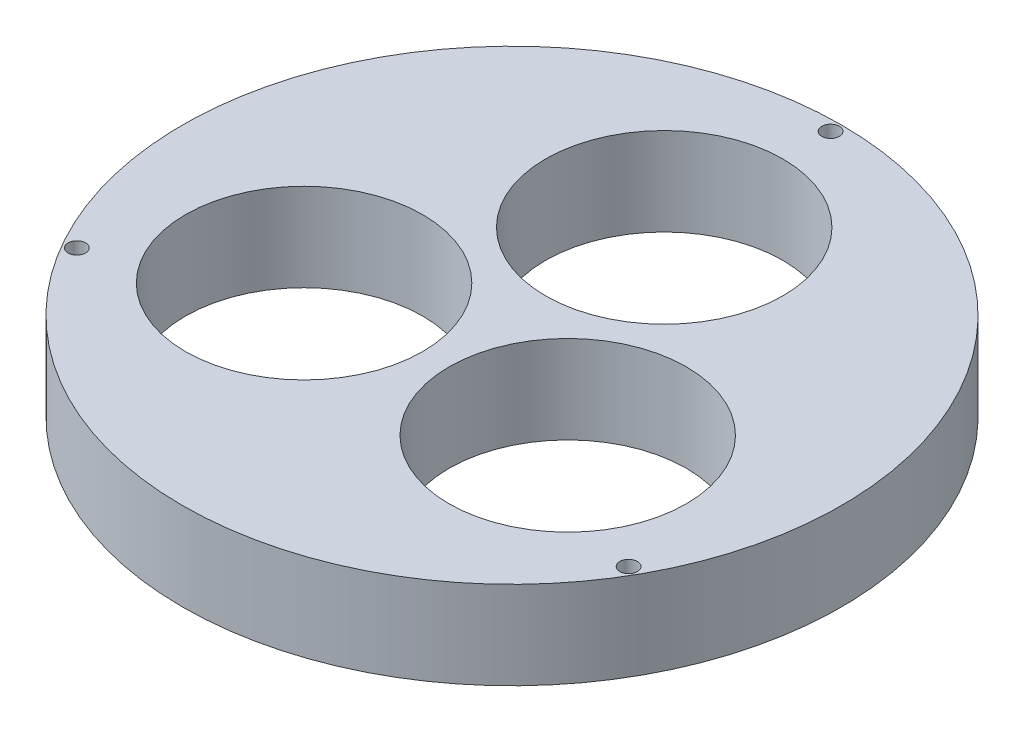
ISO-10303-21;
HEADER;
FILE_DESCRIPTION(('STEP AP214'),'2;1');
FILE_NAME('part.step','',(''),(''),'','','');
FILE_SCHEMA(('AUTOMOTIVE_DESIGN { 1 0 10303 214 1 1 1 1 }'));
ENDSEC;
DATA;
#1=APPLICATION_CONTEXT('core data for automotive mechanical design processes');
#2=APPLICATION_PROTOCOL_DEFINITION('international standard','automotive_design',2000,#1);
#3=PRODUCT_CONTEXT('',#1,'mechanical');
#4=PRODUCT('Part','Part','',(#3));
#5=PRODUCT_RELATED_PRODUCT_CATEGORY('part','',(#4));
#6=PRODUCT_DEFINITION_FORMATION('','',#4);
#7=PRODUCT_DEFINITION_CONTEXT('part definition',#1,'design');
#8=PRODUCT_DEFINITION('design','',#6,#7);
#9=PRODUCT_DEFINITION_SHAPE('','',#8);
#10=(LENGTH_UNIT() NAMED_UNIT(*) SI_UNIT(.MILLI.,.METRE.));
#11=(NAMED_UNIT(*) PLANE_ANGLE_UNIT() SI_UNIT($,.RADIAN.));
#12=(NAMED_UNIT(*) SI_UNIT($,.STERADIAN.) SOLID_ANGLE_UNIT());
#13=UNCERTAINTY_MEASURE_WITH_UNIT(LENGTH_MEASURE(1.E-05),#10,'distance_accuracy_value','');
#14=(GEOMETRIC_REPRESENTATION_CONTEXT(3) GLOBAL_UNCERTAINTY_ASSIGNED_CONTEXT((#13)) GLOBAL_UNIT_ASSIGNED_CONTEXT((#10,
#11,#12)) REPRESENTATION_CONTEXT('',''));
#15=CARTESIAN_POINT('',(0.,0.,0.));
#16=DIRECTION('',(0.,0.,1.));
#17=DIRECTION('',(1.,0.,0.));
#18=AXIS2_PLACEMENT_3D('',#15,#16,#17);
#19=CARTESIAN_POINT('',(0.,10.,0.));
#20=DIRECTION('',(0.,1.,0.));
#21=DIRECTION('',(0.,0.,1.));
#22=AXIS2_PLACEMENT_3D('',#19,#20,#21);
#23=PLANE('',#22);
#24=CARTESIAN_POINT('',(0.,10.,-36.25));
#25=DIRECTION('',(0.,1.,0.));
#26=DIRECTION('',(0.,0.,1.));
#27=AXIS2_PLACEMENT_3D('',#24,#25,#26);
#28=CIRCLE('',#27,1.);
#29=CARTESIAN_POINT('',(0.,10.,-35.25));
#30=VERTEX_POINT('',#29);
#31=EDGE_CURVE('E80',#30,#30,#28,.T.);
#32=ORIENTED_EDGE('',*,*,#31,.F.);
#33=EDGE_LOOP('',(#32));
#34=FACE_BOUND('',#33,.T.);
#35=CARTESIAN_POINT('',(-14.9995599935465,10.,8.66));
#36=DIRECTION('',(0.,1.,0.));
#37=DIRECTION('',(0.,0.,1.));
#38=AXIS2_PLACEMENT_3D('',#35,#36,#37);
#39=CIRCLE('',#38,13.5);
#40=CARTESIAN_POINT('',(-14.9995599935465,10.,22.16));
#41=VERTEX_POINT('',#40);
#42=EDGE_CURVE('E64',#41,#41,#39,.T.);
#43=ORIENTED_EDGE('',*,*,#42,.F.);
#44=EDGE_LOOP('',(#43));
#45=FACE_BOUND('',#44,.T.);
#46=CARTESIAN_POINT('',(14.9995599935465,10.,8.66));
#47=DIRECTION('',(0.,1.,0.));
#48=DIRECTION('',(0.,0.,1.));
#49=AXIS2_PLACEMENT_3D('',#46,#47,#48);
#50=CIRCLE('',#49,13.5);
#51=CARTESIAN_POINT('',(14.9995599935465,10.,22.16));
#52=VERTEX_POINT('',#51);
#53=EDGE_CURVE('E50',#52,#52,#50,.T.);
#54=ORIENTED_EDGE('',*,*,#53,.F.);
#55=EDGE_LOOP('',(#54));
#56=FACE_BOUND('',#55,.T.);
#57=CARTESIAN_POINT('',(0.,10.,0.));
#58=DIRECTION('',(0.,1.,0.));
#59=DIRECTION('',(0.,0.,1.));
#60=AXIS2_PLACEMENT_3D('',#57,#58,#59);
#61=CIRCLE('',#60,37.5);
#62=CARTESIAN_POINT('',(0.,10.,37.5));
#63=VERTEX_POINT('',#62);
#64=EDGE_CURVE('E10',#63,#63,#61,.T.);
#65=ORIENTED_EDGE('',*,*,#64,.T.);
#66=EDGE_LOOP('',(#65));
#67=FACE_BOUND('',#66,.T.);
#68=CARTESIAN_POINT('',(0.,10.,-17.32));
#69=DIRECTION('',(0.,1.,0.));
#70=DIRECTION('',(0.,0.,1.));
#71=AXIS2_PLACEMENT_3D('',#68,#69,#70);
#72=CIRCLE('',#71,13.5);
#73=CARTESIAN_POINT('',(0.,10.,-3.82));
#74=VERTEX_POINT('',#73);
#75=EDGE_CURVE('E56',#74,#74,#72,.T.);
#76=ORIENTED_EDGE('',*,*,#75,.F.);
#77=EDGE_LOOP('',(#76));
#78=FACE_BOUND('',#77,.T.);
#79=CARTESIAN_POINT('',(31.3934208871859,10.,18.125));
#80=DIRECTION('',(0.,1.,0.));
#81=DIRECTION('',(0.,0.,1.));
#82=AXIS2_PLACEMENT_3D('',#79,#80,#81);
#83=CIRCLE('',#82,0.999999999999998);
#84=CARTESIAN_POINT('',(31.3934208871859,10.,19.125));
#85=VERTEX_POINT('',#84);
#86=EDGE_CURVE('E72',#85,#85,#83,.T.);
#87=ORIENTED_EDGE('',*,*,#86,.F.);
#88=EDGE_LOOP('',(#87));
#89=FACE_BOUND('',#88,.T.);
#90=CARTESIAN_POINT('',(-31.3934208871859,10.,18.125));
#91=DIRECTION('',(0.,1.,0.));
#92=DIRECTION('',(0.,0.,1.));
#93=AXIS2_PLACEMENT_3D('',#90,#91,#92);
#94=CIRCLE('',#93,1.);
#95=CARTESIAN_POINT('',(-31.3934208871859,10.,19.125));
#96=VERTEX_POINT('',#95);
#97=EDGE_CURVE('E88',#96,#96,#94,.T.);
#98=ORIENTED_EDGE('',*,*,#97,.F.);
#99=EDGE_LOOP('',(#98));
#100=FACE_BOUND('',#99,.T.);
#101=ADVANCED_FACE('F37',(#34,#45,#56,#67,#78,#89,#100),#23,.T.);
#102=CARTESIAN_POINT('',(0.,0.,0.));
#103=DIRECTION('',(0.,1.,0.));
#104=DIRECTION('',(0.,0.,1.));
#105=AXIS2_PLACEMENT_3D('',#102,#103,#104);
#106=PLANE('',#105);
#107=CARTESIAN_POINT('',(0.,0.,0.));
#108=DIRECTION('',(0.,1.,0.));
#109=DIRECTION('',(0.,0.,1.));
#110=AXIS2_PLACEMENT_3D('',#107,#108,#109);
#111=CIRCLE('',#110,37.5);
#112=CARTESIAN_POINT('',(0.,0.,37.5));
#113=VERTEX_POINT('',#112);
#114=EDGE_CURVE('E41',#113,#113,#111,.T.);
#115=ORIENTED_EDGE('',*,*,#114,.F.);
#116=EDGE_LOOP('',(#115));
#117=FACE_BOUND('',#116,.T.);
#118=CARTESIAN_POINT('',(14.9995599935465,0.,8.66));
#119=DIRECTION('',(0.,1.,0.));
#120=DIRECTION('',(0.,0.,1.));
#121=AXIS2_PLACEMENT_3D('',#118,#119,#120);
#122=CIRCLE('',#121,13.5);
#123=CARTESIAN_POINT('',(14.9995599935465,0.,22.16));
#124=VERTEX_POINT('',#123);
#125=EDGE_CURVE('E52',#124,#124,#122,.T.);
#126=ORIENTED_EDGE('',*,*,#125,.T.);
#127=EDGE_LOOP('',(#126));
#128=FACE_BOUND('',#127,.T.);
#129=CARTESIAN_POINT('',(0.,0.,-17.32));
#130=DIRECTION('',(0.,1.,0.));
#131=DIRECTION('',(0.,0.,1.));
#132=AXIS2_PLACEMENT_3D('',#129,#130,#131);
#133=CIRCLE('',#132,13.5);
#134=CARTESIAN_POINT('',(0.,0.,-3.82));
#135=VERTEX_POINT('',#134);
#136=EDGE_CURVE('E60',#135,#135,#133,.T.);
#137=ORIENTED_EDGE('',*,*,#136,.T.);
#138=EDGE_LOOP('',(#137));
#139=FACE_BOUND('',#138,.T.);
#140=CARTESIAN_POINT('',(-14.9995599935465,0.,8.66));
#141=DIRECTION('',(0.,1.,0.));
#142=DIRECTION('',(0.,0.,1.));
#143=AXIS2_PLACEMENT_3D('',#140,#141,#142);
#144=CIRCLE('',#143,13.5);
#145=CARTESIAN_POINT('',(-14.9995599935465,0.,22.16));
#146=VERTEX_POINT('',#145);
#147=EDGE_CURVE('E68',#146,#146,#144,.T.);
#148=ORIENTED_EDGE('',*,*,#147,.T.);
#149=EDGE_LOOP('',(#148));
#150=FACE_BOUND('',#149,.T.);
#151=CARTESIAN_POINT('',(31.3934208871859,0.,18.125));
#152=DIRECTION('',(0.,1.,0.));
#153=DIRECTION('',(0.,0.,1.));
#154=AXIS2_PLACEMENT_3D('',#151,#152,#153);
#155=CIRCLE('',#154,0.999999999999998);
#156=CARTESIAN_POINT('',(31.3934208871859,0.,19.125));
#157=VERTEX_POINT('',#156);
#158=EDGE_CURVE('E76',#157,#157,#155,.T.);
#159=ORIENTED_EDGE('',*,*,#158,.T.);
#160=EDGE_LOOP('',(#159));
#161=FACE_BOUND('',#160,.T.);
#162=CARTESIAN_POINT('',(0.,0.,-36.25));
#163=DIRECTION('',(0.,1.,0.));
#164=DIRECTION('',(0.,0.,1.));
#165=AXIS2_PLACEMENT_3D('',#162,#163,#164);
#166=CIRCLE('',#165,1.);
#167=CARTESIAN_POINT('',(0.,0.,-35.25));
#168=VERTEX_POINT('',#167);
#169=EDGE_CURVE('E84',#168,#168,#166,.T.);
#170=ORIENTED_EDGE('',*,*,#169,.T.);
#171=EDGE_LOOP('',(#170));
#172=FACE_BOUND('',#171,.T.);
#173=CARTESIAN_POINT('',(-31.3934208871859,0.,18.125));
#174=DIRECTION('',(0.,1.,0.));
#175=DIRECTION('',(0.,0.,1.));
#176=AXIS2_PLACEMENT_3D('',#173,#174,#175);
#177=CIRCLE('',#176,1.);
#178=CARTESIAN_POINT('',(-31.3934208871859,0.,19.125));
#179=VERTEX_POINT('',#178);
#180=EDGE_CURVE('E92',#179,#179,#177,.T.);
#181=ORIENTED_EDGE('',*,*,#180,.T.);
#182=EDGE_LOOP('',(#181));
#183=FACE_BOUND('',#182,.T.);
#184=ADVANCED_FACE('F104',(#117,#128,#139,#150,#161,#172,#183),#106,.F.);
#185=CARTESIAN_POINT('',(0.,10.,0.));
#186=DIRECTION('',(0.,-1.,0.));
#187=DIRECTION('',(0.,0.,-1.));
#188=AXIS2_PLACEMENT_3D('',#185,#186,#187);
#189=CYLINDRICAL_SURFACE('',#188,37.5);
#190=ORIENTED_EDGE('',*,*,#64,.F.);
#191=EDGE_LOOP('',(#190));
#192=FACE_BOUND('',#191,.T.);
#193=ORIENTED_EDGE('',*,*,#114,.T.);
#194=EDGE_LOOP('',(#193));
#195=FACE_BOUND('',#194,.T.);
#196=ADVANCED_FACE('F39',(#192,#195),#189,.T.);
#197=CARTESIAN_POINT('',(14.9995599935465,10.,8.66));
#198=DIRECTION('',(0.,-1.,0.));
#199=DIRECTION('',(0.,0.,-1.));
#200=AXIS2_PLACEMENT_3D('',#197,#198,#199);
#201=CYLINDRICAL_SURFACE('',#200,13.5);
#202=ORIENTED_EDGE('',*,*,#53,.T.);
#203=EDGE_LOOP('',(#202));
#204=FACE_BOUND('',#203,.T.);
#205=ORIENTED_EDGE('',*,*,#125,.F.);
#206=EDGE_LOOP('',(#205));
#207=FACE_BOUND('',#206,.T.);
#208=ADVANCED_FACE('F114',(#204,#207),#201,.F.);
#209=CARTESIAN_POINT('',(0.,10.,-17.32));
#210=DIRECTION('',(0.,-1.,0.));
#211=DIRECTION('',(0.,0.,-1.));
#212=AXIS2_PLACEMENT_3D('',#209,#210,#211);
#213=CYLINDRICAL_SURFACE('',#212,13.5);
#214=ORIENTED_EDGE('',*,*,#75,.T.);
#215=EDGE_LOOP('',(#214));
#216=FACE_BOUND('',#215,.T.);
#217=ORIENTED_EDGE('',*,*,#136,.F.);
#218=EDGE_LOOP('',(#217));
#219=FACE_BOUND('',#218,.T.);
#220=ADVANCED_FACE('F117',(#216,#219),#213,.F.);
#221=CARTESIAN_POINT('',(-14.9995599935465,10.,8.66));
#222=DIRECTION('',(0.,-1.,0.));
#223=DIRECTION('',(0.,0.,-1.));
#224=AXIS2_PLACEMENT_3D('',#221,#222,#223);
#225=CYLINDRICAL_SURFACE('',#224,13.5);
#226=ORIENTED_EDGE('',*,*,#42,.T.);
#227=EDGE_LOOP('',(#226));
#228=FACE_BOUND('',#227,.T.);
#229=ORIENTED_EDGE('',*,*,#147,.F.);
#230=EDGE_LOOP('',(#229));
#231=FACE_BOUND('',#230,.T.);
#232=ADVANCED_FACE('F121',(#228,#231),#225,.F.);
#233=CARTESIAN_POINT('',(31.3934208871859,10.,18.125));
#234=DIRECTION('',(0.,-1.,0.));
#235=DIRECTION('',(0.,0.,-1.));
#236=AXIS2_PLACEMENT_3D('',#233,#234,#235);
#237=CYLINDRICAL_SURFACE('',#236,0.999999999999998);
#238=ORIENTED_EDGE('',*,*,#86,.T.);
#239=EDGE_LOOP('',(#238));
#240=FACE_BOUND('',#239,.T.);
#241=ORIENTED_EDGE('',*,*,#158,.F.);
#242=EDGE_LOOP('',(#241));
#243=FACE_BOUND('',#242,.T.);
#244=ADVANCED_FACE('F125',(#240,#243),#237,.F.);
#245=CARTESIAN_POINT('',(0.,10.,-36.25));
#246=DIRECTION('',(0.,-1.,0.));
#247=DIRECTION('',(0.,0.,-1.));
#248=AXIS2_PLACEMENT_3D('',#245,#246,#247);
#249=CYLINDRICAL_SURFACE('',#248,1.);
#250=ORIENTED_EDGE('',*,*,#31,.T.);
#251=EDGE_LOOP('',(#250));
#252=FACE_BOUND('',#251,.T.);
#253=ORIENTED_EDGE('',*,*,#169,.F.);
#254=EDGE_LOOP('',(#253));
#255=FACE_BOUND('',#254,.T.);
#256=ADVANCED_FACE('F129',(#252,#255),#249,.F.);
#257=CARTESIAN_POINT('',(-31.3934208871859,10.,18.125));
#258=DIRECTION('',(0.,-1.,0.));
#259=DIRECTION('',(0.,0.,-1.));
#260=AXIS2_PLACEMENT_3D('',#257,#258,#259);
#261=CYLINDRICAL_SURFACE('',#260,1.);
#262=ORIENTED_EDGE('',*,*,#97,.T.);
#263=EDGE_LOOP('',(#262));
#264=FACE_BOUND('',#263,.T.);
#265=ORIENTED_EDGE('',*,*,#180,.F.);
#266=EDGE_LOOP('',(#265));
#267=FACE_BOUND('',#266,.T.);
#268=ADVANCED_FACE('F100',(#264,#267),#261,.F.);
#269=CLOSED_SHELL('',(#101,#184,#196,#208,#220,#232,#244,#256,#268));
#270=MANIFOLD_SOLID_BREP('B2',#269);
#271=ADVANCED_BREP_SHAPE_REPRESENTATION('',(#18,#270),#14);
#272=SHAPE_DEFINITION_REPRESENTATION(#9,#271);
ENDSEC;
END-ISO-10303-21;
